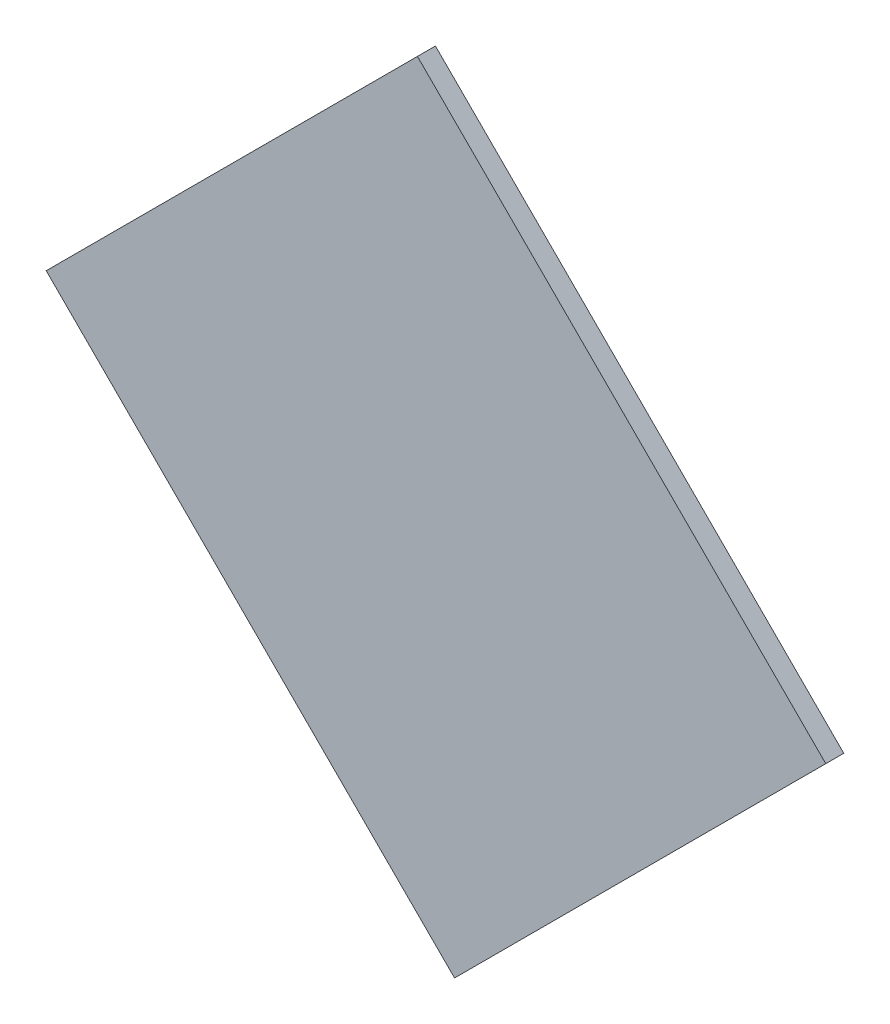
ISO-10303-21;
HEADER;
FILE_DESCRIPTION(('STEP AP214'),'2;1');
FILE_NAME('part.step','',(''),(''),'','','');
FILE_SCHEMA(('AUTOMOTIVE_DESIGN { 1 0 10303 214 1 1 1 1 }'));
ENDSEC;
DATA;
#1=APPLICATION_CONTEXT('core data for automotive mechanical design processes');
#2=APPLICATION_PROTOCOL_DEFINITION('international standard','automotive_design',2000,#1);
#3=PRODUCT_CONTEXT('',#1,'mechanical');
#4=PRODUCT('Part','Part','',(#3));
#5=PRODUCT_RELATED_PRODUCT_CATEGORY('part','',(#4));
#6=PRODUCT_DEFINITION_FORMATION('','',#4);
#7=PRODUCT_DEFINITION_CONTEXT('part definition',#1,'design');
#8=PRODUCT_DEFINITION('design','',#6,#7);
#9=PRODUCT_DEFINITION_SHAPE('','',#8);
#10=(LENGTH_UNIT() NAMED_UNIT(*) SI_UNIT(.MILLI.,.METRE.));
#11=(NAMED_UNIT(*) PLANE_ANGLE_UNIT() SI_UNIT($,.RADIAN.));
#12=(NAMED_UNIT(*) SI_UNIT($,.STERADIAN.) SOLID_ANGLE_UNIT());
#13=UNCERTAINTY_MEASURE_WITH_UNIT(LENGTH_MEASURE(1.E-05),#10,'distance_accuracy_value','');
#14=(GEOMETRIC_REPRESENTATION_CONTEXT(3) GLOBAL_UNCERTAINTY_ASSIGNED_CONTEXT((#13)) GLOBAL_UNIT_ASSIGNED_CONTEXT((#10,
#11,#12)) REPRESENTATION_CONTEXT('',''));
#15=CARTESIAN_POINT('',(0.,0.,0.));
#16=DIRECTION('',(0.,0.,1.));
#17=DIRECTION('',(1.,0.,0.));
#18=AXIS2_PLACEMENT_3D('',#15,#16,#17);
#19=CARTESIAN_POINT('',(9.793934,9.095056,0.79916));
#20=DIRECTION('',(0.,0.,1.));
#21=DIRECTION('',(0.,-1.,0.));
#22=AXIS2_PLACEMENT_3D('',#19,#20,#21);
#23=PLANE('',#22);
#24=DIRECTION('',(0.707106781186548,0.707106781186548,0.));
#25=VECTOR('',#24,1.);
#26=CARTESIAN_POINT('',(9.051472,9.130411333,0.79916));
#27=LINE('',#26,#25);
#28=CARTESIAN_POINT('',(9.758578667,9.837518,0.79916));
#29=VERTEX_POINT('',#28);
#30=CARTESIAN_POINT('',(9.051472,9.130411333,0.79916));
#31=VERTEX_POINT('',#30);
#32=EDGE_CURVE('E68',#29,#31,#27,.F.);
#33=ORIENTED_EDGE('',*,*,#32,.T.);
#34=DIRECTION('',(-0.707106781186548,0.707106781186548,0.));
#35=VECTOR('',#34,1.);
#36=CARTESIAN_POINT('',(9.829289333,8.352594,0.79916));
#37=LINE('',#36,#35);
#38=CARTESIAN_POINT('',(9.829289333,8.352594,0.79916));
#39=VERTEX_POINT('',#38);
#40=EDGE_CURVE('E55',#31,#39,#37,.F.);
#41=ORIENTED_EDGE('',*,*,#40,.T.);
#42=DIRECTION('',(-0.707106781186548,-0.707106781186548,0.));
#43=VECTOR('',#42,1.);
#44=CARTESIAN_POINT('',(10.536396,9.059700667,0.79916));
#45=LINE('',#44,#43);
#46=CARTESIAN_POINT('',(10.536396,9.059700667,0.79916));
#47=VERTEX_POINT('',#46);
#48=EDGE_CURVE('E20',#39,#47,#45,.F.);
#49=ORIENTED_EDGE('',*,*,#48,.T.);
#50=DIRECTION('',(0.707106781186548,-0.707106781186548,0.));
#51=VECTOR('',#50,1.);
#52=CARTESIAN_POINT('',(9.758578667,9.837518,0.79916));
#53=LINE('',#52,#51);
#54=EDGE_CURVE('E81',#47,#29,#53,.F.);
#55=ORIENTED_EDGE('',*,*,#54,.T.);
#56=EDGE_LOOP('',(#33,#41,#49,#55));
#57=FACE_BOUND('',#56,.T.);
#58=ADVANCED_FACE('F17',(#57),#23,.T.);
#59=CARTESIAN_POINT('',(10.536396,9.059700667,0.76487));
#60=DIRECTION('',(-0.707106781186548,0.707106781186548,0.));
#61=DIRECTION('',(-0.707106781186548,-0.707106781186548,0.));
#62=AXIS2_PLACEMENT_3D('',#59,#60,#61);
#63=PLANE('',#62);
#64=DIRECTION('',(0.,0.,1.));
#65=VECTOR('',#64,1.);
#66=CARTESIAN_POINT('',(9.829289333,8.352594,0.76487));
#67=LINE('',#66,#65);
#68=CARTESIAN_POINT('',(9.829289333,8.352594,0.76487));
#69=VERTEX_POINT('',#68);
#70=EDGE_CURVE('E61',#39,#69,#67,.F.);
#71=ORIENTED_EDGE('',*,*,#70,.T.);
#72=DIRECTION('',(-0.707106781186547,-0.707106781186547,0.));
#73=VECTOR('',#72,1.);
#74=CARTESIAN_POINT('',(10.536396,9.059700667,0.76487));
#75=LINE('',#74,#73);
#76=CARTESIAN_POINT('',(10.536396,9.059700667,0.76487));
#77=VERTEX_POINT('',#76);
#78=EDGE_CURVE('E83',#77,#69,#75,.T.);
#79=ORIENTED_EDGE('',*,*,#78,.F.);
#80=DIRECTION('',(0.,0.,1.));
#81=VECTOR('',#80,1.);
#82=CARTESIAN_POINT('',(10.536396,9.059700667,0.76487));
#83=LINE('',#82,#81);
#84=EDGE_CURVE('E64',#77,#47,#83,.T.);
#85=ORIENTED_EDGE('',*,*,#84,.T.);
#86=ORIENTED_EDGE('',*,*,#48,.F.);
#87=EDGE_LOOP('',(#71,#79,#85,#86));
#88=FACE_BOUND('',#87,.T.);
#89=ADVANCED_FACE('F60',(#88),#63,.F.);
#90=CARTESIAN_POINT('',(9.829289333,8.352594,0.76487));
#91=DIRECTION('',(0.707106781186548,0.707106781186548,0.));
#92=DIRECTION('',(-0.707106781186548,0.707106781186548,0.));
#93=AXIS2_PLACEMENT_3D('',#90,#91,#92);
#94=PLANE('',#93);
#95=DIRECTION('',(0.,0.,1.));
#96=VECTOR('',#95,1.);
#97=CARTESIAN_POINT('',(9.051472,9.130411333,0.76487));
#98=LINE('',#97,#96);
#99=CARTESIAN_POINT('',(9.051472,9.130411333,0.76487));
#100=VERTEX_POINT('',#99);
#101=EDGE_CURVE('E70',#31,#100,#98,.F.);
#102=ORIENTED_EDGE('',*,*,#101,.T.);
#103=DIRECTION('',(-0.707106781186547,0.707106781186548,0.));
#104=VECTOR('',#103,1.);
#105=CARTESIAN_POINT('',(9.829289333,8.352594,0.76487));
#106=LINE('',#105,#104);
#107=EDGE_CURVE('E74',#69,#100,#106,.T.);
#108=ORIENTED_EDGE('',*,*,#107,.F.);
#109=ORIENTED_EDGE('',*,*,#70,.F.);
#110=ORIENTED_EDGE('',*,*,#40,.F.);
#111=EDGE_LOOP('',(#102,#108,#109,#110));
#112=FACE_BOUND('',#111,.T.);
#113=ADVANCED_FACE('F72',(#112),#94,.F.);
#114=CARTESIAN_POINT('',(9.051472,9.130411333,0.76487));
#115=DIRECTION('',(0.707106781186548,-0.707106781186548,0.));
#116=DIRECTION('',(0.707106781186548,0.707106781186548,0.));
#117=AXIS2_PLACEMENT_3D('',#114,#115,#116);
#118=PLANE('',#117);
#119=DIRECTION('',(0.,0.,1.));
#120=VECTOR('',#119,1.);
#121=CARTESIAN_POINT('',(9.758578667,9.837518,0.76487));
#122=LINE('',#121,#120);
#123=CARTESIAN_POINT('',(9.758578667,9.837518,0.76487));
#124=VERTEX_POINT('',#123);
#125=EDGE_CURVE('E35',#29,#124,#122,.F.);
#126=ORIENTED_EDGE('',*,*,#125,.T.);
#127=DIRECTION('',(0.707106781186547,0.707106781186547,0.));
#128=VECTOR('',#127,1.);
#129=CARTESIAN_POINT('',(9.051472,9.130411333,0.76487));
#130=LINE('',#129,#128);
#131=EDGE_CURVE('E26',#100,#124,#130,.T.);
#132=ORIENTED_EDGE('',*,*,#131,.F.);
#133=ORIENTED_EDGE('',*,*,#101,.F.);
#134=ORIENTED_EDGE('',*,*,#32,.F.);
#135=EDGE_LOOP('',(#126,#132,#133,#134));
#136=FACE_BOUND('',#135,.T.);
#137=ADVANCED_FACE('F89',(#136),#118,.F.);
#138=CARTESIAN_POINT('',(9.758578667,9.837518,0.76487));
#139=DIRECTION('',(-0.707106781186548,-0.707106781186548,0.));
#140=DIRECTION('',(0.707106781186548,-0.707106781186548,0.));
#141=AXIS2_PLACEMENT_3D('',#138,#139,#140);
#142=PLANE('',#141);
#143=ORIENTED_EDGE('',*,*,#84,.F.);
#144=DIRECTION('',(0.707106781186547,-0.707106781186548,0.));
#145=VECTOR('',#144,1.);
#146=CARTESIAN_POINT('',(9.758578667,9.837518,0.76487));
#147=LINE('',#146,#145);
#148=EDGE_CURVE('E11',#124,#77,#147,.T.);
#149=ORIENTED_EDGE('',*,*,#148,.F.);
#150=ORIENTED_EDGE('',*,*,#125,.F.);
#151=ORIENTED_EDGE('',*,*,#54,.F.);
#152=EDGE_LOOP('',(#143,#149,#150,#151));
#153=FACE_BOUND('',#152,.T.);
#154=ADVANCED_FACE('F91',(#153),#142,.F.);
#155=CARTESIAN_POINT('',(9.793934,9.095056,0.76487));
#156=DIRECTION('',(0.,0.,-1.));
#157=DIRECTION('',(0.,1.,0.));
#158=AXIS2_PLACEMENT_3D('',#155,#156,#157);
#159=PLANE('',#158);
#160=ORIENTED_EDGE('',*,*,#131,.T.);
#161=ORIENTED_EDGE('',*,*,#148,.T.);
#162=ORIENTED_EDGE('',*,*,#78,.T.);
#163=ORIENTED_EDGE('',*,*,#107,.T.);
#164=EDGE_LOOP('',(#160,#161,#162,#163));
#165=FACE_BOUND('',#164,.T.);
#166=ADVANCED_FACE('F88',(#165),#159,.T.);
#167=CLOSED_SHELL('',(#58,#89,#113,#137,#154,#166));
#168=MANIFOLD_SOLID_BREP('B1',#167);
#169=ADVANCED_BREP_SHAPE_REPRESENTATION('',(#18,#168),#14);
#170=SHAPE_DEFINITION_REPRESENTATION(#9,#169);
ENDSEC;
END-ISO-10303-21;
